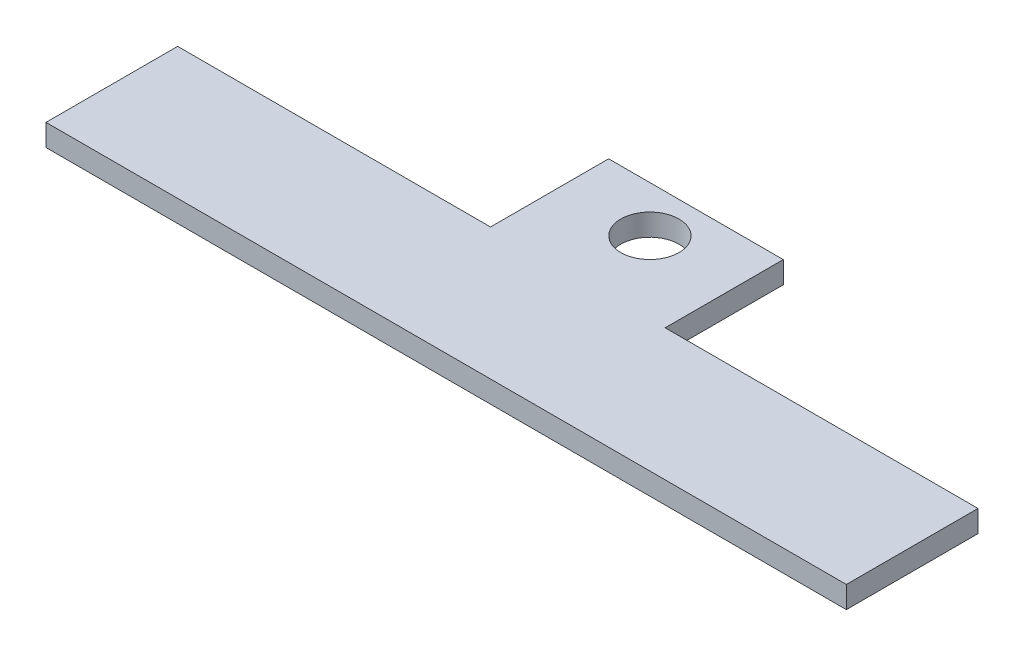
ISO-10303-21;
HEADER;
FILE_DESCRIPTION(('STEP AP214'),'2;1');
FILE_NAME('part.step','',(''),(''),'','','');
FILE_SCHEMA(('AUTOMOTIVE_DESIGN { 1 0 10303 214 1 1 1 1 }'));
ENDSEC;
DATA;
#1=APPLICATION_CONTEXT('core data for automotive mechanical design processes');
#2=APPLICATION_PROTOCOL_DEFINITION('international standard','automotive_design',2000,#1);
#3=PRODUCT_CONTEXT('',#1,'mechanical');
#4=PRODUCT('Part','Part','',(#3));
#5=PRODUCT_RELATED_PRODUCT_CATEGORY('part','',(#4));
#6=PRODUCT_DEFINITION_FORMATION('','',#4);
#7=PRODUCT_DEFINITION_CONTEXT('part definition',#1,'design');
#8=PRODUCT_DEFINITION('design','',#6,#7);
#9=PRODUCT_DEFINITION_SHAPE('','',#8);
#10=(LENGTH_UNIT() NAMED_UNIT(*) SI_UNIT(.MILLI.,.METRE.));
#11=(NAMED_UNIT(*) PLANE_ANGLE_UNIT() SI_UNIT($,.RADIAN.));
#12=(NAMED_UNIT(*) SI_UNIT($,.STERADIAN.) SOLID_ANGLE_UNIT());
#13=UNCERTAINTY_MEASURE_WITH_UNIT(LENGTH_MEASURE(1.E-05),#10,'distance_accuracy_value','');
#14=(GEOMETRIC_REPRESENTATION_CONTEXT(3) GLOBAL_UNCERTAINTY_ASSIGNED_CONTEXT((#13)) GLOBAL_UNIT_ASSIGNED_CONTEXT((#10,
#11,#12)) REPRESENTATION_CONTEXT('',''));
#15=CARTESIAN_POINT('',(0.,0.,0.));
#16=DIRECTION('',(0.,0.,1.));
#17=DIRECTION('',(1.,0.,0.));
#18=AXIS2_PLACEMENT_3D('',#15,#16,#17);
#19=CARTESIAN_POINT('',(0.,1.5,0.));
#20=DIRECTION('',(0.,-1.,0.));
#21=DIRECTION('',(0.,0.,-1.));
#22=AXIS2_PLACEMENT_3D('',#19,#20,#21);
#23=PLANE('',#22);
#24=DIRECTION('',(0.,0.,1.));
#25=VECTOR('',#24,1.);
#26=CARTESIAN_POINT('',(0.,1.5,0.));
#27=LINE('',#26,#25);
#28=CARTESIAN_POINT('',(0.,1.5,-9.04646840470653));
#29=VERTEX_POINT('',#28);
#30=CARTESIAN_POINT('',(0.,1.5,0.));
#31=VERTEX_POINT('',#30);
#32=EDGE_CURVE('E145',#29,#31,#27,.T.);
#33=ORIENTED_EDGE('',*,*,#32,.T.);
#34=DIRECTION('',(1.,0.,0.));
#35=VECTOR('',#34,1.);
#36=CARTESIAN_POINT('',(0.,1.5,0.));
#37=LINE('',#36,#35);
#38=CARTESIAN_POINT('',(55.,1.5,0.));
#39=VERTEX_POINT('',#38);
#40=EDGE_CURVE('E93',#31,#39,#37,.T.);
#41=ORIENTED_EDGE('',*,*,#40,.T.);
#42=DIRECTION('',(0.,0.,-1.));
#43=VECTOR('',#42,1.);
#44=CARTESIAN_POINT('',(55.,1.5,0.));
#45=LINE('',#44,#43);
#46=CARTESIAN_POINT('',(55.,1.5,-9.04646840470653));
#47=VERTEX_POINT('',#46);
#48=EDGE_CURVE('E160',#39,#47,#45,.T.);
#49=ORIENTED_EDGE('',*,*,#48,.T.);
#50=DIRECTION('',(-1.,0.,0.));
#51=VECTOR('',#50,1.);
#52=CARTESIAN_POINT('',(33.5,1.5,-9.04646840470653));
#53=LINE('',#52,#51);
#54=CARTESIAN_POINT('',(33.5,1.5,-9.04646840470653));
#55=VERTEX_POINT('',#54);
#56=EDGE_CURVE('E173',#47,#55,#53,.T.);
#57=ORIENTED_EDGE('',*,*,#56,.T.);
#58=DIRECTION('',(0.,0.,-1.));
#59=VECTOR('',#58,1.);
#60=CARTESIAN_POINT('',(33.5,1.5,-17.1649124070522));
#61=LINE('',#60,#59);
#62=CARTESIAN_POINT('',(33.5,1.5,-17.1649124070522));
#63=VERTEX_POINT('',#62);
#64=EDGE_CURVE('E112',#55,#63,#61,.T.);
#65=ORIENTED_EDGE('',*,*,#64,.T.);
#66=DIRECTION('',(-1.,0.,0.));
#67=VECTOR('',#66,1.);
#68=CARTESIAN_POINT('',(21.5,1.5,-17.1649124070522));
#69=LINE('',#68,#67);
#70=CARTESIAN_POINT('',(21.5,1.5,-17.1649124070522));
#71=VERTEX_POINT('',#70);
#72=EDGE_CURVE('E106',#63,#71,#69,.T.);
#73=ORIENTED_EDGE('',*,*,#72,.T.);
#74=DIRECTION('',(0.,0.,1.));
#75=VECTOR('',#74,1.);
#76=CARTESIAN_POINT('',(21.5,1.5,-9.04646840470653));
#77=LINE('',#76,#75);
#78=CARTESIAN_POINT('',(21.5,1.5,-9.04646840470653));
#79=VERTEX_POINT('',#78);
#80=EDGE_CURVE('E110',#71,#79,#77,.T.);
#81=ORIENTED_EDGE('',*,*,#80,.T.);
#82=DIRECTION('',(-1.,0.,0.));
#83=VECTOR('',#82,1.);
#84=CARTESIAN_POINT('',(0.,1.5,-9.04646840470653));
#85=LINE('',#84,#83);
#86=EDGE_CURVE('E50',#79,#29,#85,.T.);
#87=ORIENTED_EDGE('',*,*,#86,.T.);
#88=EDGE_LOOP('',(#33,#41,#49,#57,#65,#73,#81,#87));
#89=FACE_BOUND('',#88,.T.);
#90=CARTESIAN_POINT('',(27.5,1.5,-14.));
#91=DIRECTION('',(0.,1.,0.));
#92=DIRECTION('',(0.,0.,-1.));
#93=AXIS2_PLACEMENT_3D('',#90,#91,#92);
#94=CIRCLE('',#93,2.00000000000001);
#95=CARTESIAN_POINT('',(27.5,1.5,-16.));
#96=VERTEX_POINT('',#95);
#97=EDGE_CURVE('E134',#96,#96,#94,.T.);
#98=ORIENTED_EDGE('',*,*,#97,.F.);
#99=EDGE_LOOP('',(#98));
#100=FACE_BOUND('',#99,.T.);
#101=ADVANCED_FACE('F33',(#89,#100),#23,.F.);
#102=CARTESIAN_POINT('',(0.,0.,0.));
#103=DIRECTION('',(0.,-1.,0.));
#104=DIRECTION('',(0.,0.,-1.));
#105=AXIS2_PLACEMENT_3D('',#102,#103,#104);
#106=PLANE('',#105);
#107=DIRECTION('',(0.,0.,1.));
#108=VECTOR('',#107,1.);
#109=CARTESIAN_POINT('',(0.,0.,0.));
#110=LINE('',#109,#108);
#111=CARTESIAN_POINT('',(0.,0.,-9.04646840470653));
#112=VERTEX_POINT('',#111);
#113=CARTESIAN_POINT('',(0.,0.,0.));
#114=VERTEX_POINT('',#113);
#115=EDGE_CURVE('E130',#112,#114,#110,.T.);
#116=ORIENTED_EDGE('',*,*,#115,.F.);
#117=DIRECTION('',(-1.,0.,0.));
#118=VECTOR('',#117,1.);
#119=CARTESIAN_POINT('',(0.,0.,-9.04646840470653));
#120=LINE('',#119,#118);
#121=CARTESIAN_POINT('',(21.5,0.,-9.04646840470653));
#122=VERTEX_POINT('',#121);
#123=EDGE_CURVE('E85',#122,#112,#120,.T.);
#124=ORIENTED_EDGE('',*,*,#123,.F.);
#125=DIRECTION('',(0.,0.,1.));
#126=VECTOR('',#125,1.);
#127=CARTESIAN_POINT('',(21.5,0.,-9.04646840470653));
#128=LINE('',#127,#126);
#129=CARTESIAN_POINT('',(21.5,0.,-17.1649124070522));
#130=VERTEX_POINT('',#129);
#131=EDGE_CURVE('E79',#130,#122,#128,.T.);
#132=ORIENTED_EDGE('',*,*,#131,.F.);
#133=DIRECTION('',(-1.,0.,0.));
#134=VECTOR('',#133,1.);
#135=CARTESIAN_POINT('',(21.5,0.,-17.1649124070522));
#136=LINE('',#135,#134);
#137=CARTESIAN_POINT('',(33.5,0.,-17.1649124070522));
#138=VERTEX_POINT('',#137);
#139=EDGE_CURVE('E120',#138,#130,#136,.T.);
#140=ORIENTED_EDGE('',*,*,#139,.F.);
#141=DIRECTION('',(0.,0.,-1.));
#142=VECTOR('',#141,1.);
#143=CARTESIAN_POINT('',(33.5,0.,-17.1649124070522));
#144=LINE('',#143,#142);
#145=CARTESIAN_POINT('',(33.5,0.,-9.04646840470653));
#146=VERTEX_POINT('',#145);
#147=EDGE_CURVE('E140',#146,#138,#144,.T.);
#148=ORIENTED_EDGE('',*,*,#147,.F.);
#149=DIRECTION('',(-1.,0.,0.));
#150=VECTOR('',#149,1.);
#151=CARTESIAN_POINT('',(33.5,0.,-9.04646840470653));
#152=LINE('',#151,#150);
#153=CARTESIAN_POINT('',(55.,0.,-9.04646840470653));
#154=VERTEX_POINT('',#153);
#155=EDGE_CURVE('E138',#154,#146,#152,.T.);
#156=ORIENTED_EDGE('',*,*,#155,.F.);
#157=DIRECTION('',(0.,0.,-1.));
#158=VECTOR('',#157,1.);
#159=CARTESIAN_POINT('',(55.,0.,0.));
#160=LINE('',#159,#158);
#161=CARTESIAN_POINT('',(55.,0.,0.));
#162=VERTEX_POINT('',#161);
#163=EDGE_CURVE('E136',#162,#154,#160,.T.);
#164=ORIENTED_EDGE('',*,*,#163,.F.);
#165=DIRECTION('',(1.,0.,0.));
#166=VECTOR('',#165,1.);
#167=CARTESIAN_POINT('',(0.,0.,0.));
#168=LINE('',#167,#166);
#169=EDGE_CURVE('E133',#114,#162,#168,.T.);
#170=ORIENTED_EDGE('',*,*,#169,.F.);
#171=EDGE_LOOP('',(#116,#124,#132,#140,#148,#156,#164,#170));
#172=FACE_BOUND('',#171,.T.);
#173=CARTESIAN_POINT('',(27.5,0.,-14.));
#174=DIRECTION('',(0.,1.,0.));
#175=DIRECTION('',(0.,0.,-1.));
#176=AXIS2_PLACEMENT_3D('',#173,#174,#175);
#177=CIRCLE('',#176,2.00000000000001);
#178=CARTESIAN_POINT('',(27.5,0.,-16.));
#179=VERTEX_POINT('',#178);
#180=EDGE_CURVE('E179',#179,#179,#177,.T.);
#181=ORIENTED_EDGE('',*,*,#180,.T.);
#182=EDGE_LOOP('',(#181));
#183=FACE_BOUND('',#182,.T.);
#184=ADVANCED_FACE('F164',(#172,#183),#106,.T.);
#185=CARTESIAN_POINT('',(0.,1.5,0.));
#186=DIRECTION('',(1.,0.,0.));
#187=DIRECTION('',(0.,0.,-1.));
#188=AXIS2_PLACEMENT_3D('',#185,#186,#187);
#189=PLANE('',#188);
#190=ORIENTED_EDGE('',*,*,#115,.T.);
#191=DIRECTION('',(0.,-1.,0.));
#192=VECTOR('',#191,1.);
#193=CARTESIAN_POINT('',(0.,1.5,0.));
#194=LINE('',#193,#192);
#195=EDGE_CURVE('E11',#31,#114,#194,.T.);
#196=ORIENTED_EDGE('',*,*,#195,.F.);
#197=ORIENTED_EDGE('',*,*,#32,.F.);
#198=DIRECTION('',(0.,-1.,0.));
#199=VECTOR('',#198,1.);
#200=CARTESIAN_POINT('',(0.,1.5,-9.04646840470653));
#201=LINE('',#200,#199);
#202=EDGE_CURVE('E126',#29,#112,#201,.T.);
#203=ORIENTED_EDGE('',*,*,#202,.T.);
#204=EDGE_LOOP('',(#190,#196,#197,#203));
#205=FACE_BOUND('',#204,.T.);
#206=ADVANCED_FACE('F35',(#205),#189,.F.);
#207=CARTESIAN_POINT('',(0.,1.5,0.));
#208=DIRECTION('',(0.,0.,-1.));
#209=DIRECTION('',(-1.,0.,0.));
#210=AXIS2_PLACEMENT_3D('',#207,#208,#209);
#211=PLANE('',#210);
#212=ORIENTED_EDGE('',*,*,#169,.T.);
#213=DIRECTION('',(0.,-1.,0.));
#214=VECTOR('',#213,1.);
#215=CARTESIAN_POINT('',(55.,1.5,0.));
#216=LINE('',#215,#214);
#217=EDGE_CURVE('E42',#39,#162,#216,.T.);
#218=ORIENTED_EDGE('',*,*,#217,.F.);
#219=ORIENTED_EDGE('',*,*,#40,.F.);
#220=ORIENTED_EDGE('',*,*,#195,.T.);
#221=EDGE_LOOP('',(#212,#218,#219,#220));
#222=FACE_BOUND('',#221,.T.);
#223=ADVANCED_FACE('F207',(#222),#211,.F.);
#224=CARTESIAN_POINT('',(55.,1.5,0.));
#225=DIRECTION('',(-1.,0.,0.));
#226=DIRECTION('',(0.,0.,1.));
#227=AXIS2_PLACEMENT_3D('',#224,#225,#226);
#228=PLANE('',#227);
#229=ORIENTED_EDGE('',*,*,#163,.T.);
#230=DIRECTION('',(0.,-1.,0.));
#231=VECTOR('',#230,1.);
#232=CARTESIAN_POINT('',(55.,1.5,-9.04646840470653));
#233=LINE('',#232,#231);
#234=EDGE_CURVE('E152',#47,#154,#233,.T.);
#235=ORIENTED_EDGE('',*,*,#234,.F.);
#236=ORIENTED_EDGE('',*,*,#48,.F.);
#237=ORIENTED_EDGE('',*,*,#217,.T.);
#238=EDGE_LOOP('',(#229,#235,#236,#237));
#239=FACE_BOUND('',#238,.T.);
#240=ADVANCED_FACE('F158',(#239),#228,.F.);
#241=CARTESIAN_POINT('',(33.5,1.5,-9.04646840470653));
#242=DIRECTION('',(0.,0.,1.));
#243=DIRECTION('',(1.,0.,0.));
#244=AXIS2_PLACEMENT_3D('',#241,#242,#243);
#245=PLANE('',#244);
#246=ORIENTED_EDGE('',*,*,#155,.T.);
#247=DIRECTION('',(0.,-1.,0.));
#248=VECTOR('',#247,1.);
#249=CARTESIAN_POINT('',(33.5,1.5,-9.04646840470653));
#250=LINE('',#249,#248);
#251=EDGE_CURVE('E149',#55,#146,#250,.T.);
#252=ORIENTED_EDGE('',*,*,#251,.F.);
#253=ORIENTED_EDGE('',*,*,#56,.F.);
#254=ORIENTED_EDGE('',*,*,#234,.T.);
#255=EDGE_LOOP('',(#246,#252,#253,#254));
#256=FACE_BOUND('',#255,.T.);
#257=ADVANCED_FACE('F169',(#256),#245,.F.);
#258=CARTESIAN_POINT('',(33.5,1.5,-17.1649124070522));
#259=DIRECTION('',(-1.,0.,0.));
#260=DIRECTION('',(0.,0.,1.));
#261=AXIS2_PLACEMENT_3D('',#258,#259,#260);
#262=PLANE('',#261);
#263=ORIENTED_EDGE('',*,*,#147,.T.);
#264=DIRECTION('',(0.,-1.,0.));
#265=VECTOR('',#264,1.);
#266=CARTESIAN_POINT('',(33.5,1.5,-17.1649124070522));
#267=LINE('',#266,#265);
#268=EDGE_CURVE('E121',#63,#138,#267,.T.);
#269=ORIENTED_EDGE('',*,*,#268,.F.);
#270=ORIENTED_EDGE('',*,*,#64,.F.);
#271=ORIENTED_EDGE('',*,*,#251,.T.);
#272=EDGE_LOOP('',(#263,#269,#270,#271));
#273=FACE_BOUND('',#272,.T.);
#274=ADVANCED_FACE('F172',(#273),#262,.F.);
#275=CARTESIAN_POINT('',(21.5,1.5,-17.1649124070522));
#276=DIRECTION('',(0.,0.,1.));
#277=DIRECTION('',(1.,0.,0.));
#278=AXIS2_PLACEMENT_3D('',#275,#276,#277);
#279=PLANE('',#278);
#280=ORIENTED_EDGE('',*,*,#139,.T.);
#281=DIRECTION('',(0.,-1.,0.));
#282=VECTOR('',#281,1.);
#283=CARTESIAN_POINT('',(21.5,1.5,-17.1649124070522));
#284=LINE('',#283,#282);
#285=EDGE_CURVE('E117',#71,#130,#284,.T.);
#286=ORIENTED_EDGE('',*,*,#285,.F.);
#287=ORIENTED_EDGE('',*,*,#72,.F.);
#288=ORIENTED_EDGE('',*,*,#268,.T.);
#289=EDGE_LOOP('',(#280,#286,#287,#288));
#290=FACE_BOUND('',#289,.T.);
#291=ADVANCED_FACE('F118',(#290),#279,.F.);
#292=CARTESIAN_POINT('',(21.5,1.5,-9.04646840470653));
#293=DIRECTION('',(1.,0.,0.));
#294=DIRECTION('',(0.,0.,-1.));
#295=AXIS2_PLACEMENT_3D('',#292,#293,#294);
#296=PLANE('',#295);
#297=ORIENTED_EDGE('',*,*,#131,.T.);
#298=DIRECTION('',(0.,-1.,0.));
#299=VECTOR('',#298,1.);
#300=CARTESIAN_POINT('',(21.5,1.5,-9.04646840470653));
#301=LINE('',#300,#299);
#302=EDGE_CURVE('E122',#79,#122,#301,.T.);
#303=ORIENTED_EDGE('',*,*,#302,.F.);
#304=ORIENTED_EDGE('',*,*,#80,.F.);
#305=ORIENTED_EDGE('',*,*,#285,.T.);
#306=EDGE_LOOP('',(#297,#303,#304,#305));
#307=FACE_BOUND('',#306,.T.);
#308=ADVANCED_FACE('F124',(#307),#296,.F.);
#309=CARTESIAN_POINT('',(0.,1.5,-9.04646840470653));
#310=DIRECTION('',(0.,0.,1.));
#311=DIRECTION('',(1.,0.,0.));
#312=AXIS2_PLACEMENT_3D('',#309,#310,#311);
#313=PLANE('',#312);
#314=ORIENTED_EDGE('',*,*,#123,.T.);
#315=ORIENTED_EDGE('',*,*,#202,.F.);
#316=ORIENTED_EDGE('',*,*,#86,.F.);
#317=ORIENTED_EDGE('',*,*,#302,.T.);
#318=EDGE_LOOP('',(#314,#315,#316,#317));
#319=FACE_BOUND('',#318,.T.);
#320=ADVANCED_FACE('F195',(#319),#313,.F.);
#321=CARTESIAN_POINT('',(27.5,1.5,-14.));
#322=DIRECTION('',(0.,-1.,0.));
#323=DIRECTION('',(0.,0.,-1.));
#324=AXIS2_PLACEMENT_3D('',#321,#322,#323);
#325=CYLINDRICAL_SURFACE('',#324,2.00000000000001);
#326=ORIENTED_EDGE('',*,*,#97,.T.);
#327=EDGE_LOOP('',(#326));
#328=FACE_BOUND('',#327,.T.);
#329=ORIENTED_EDGE('',*,*,#180,.F.);
#330=EDGE_LOOP('',(#329));
#331=FACE_BOUND('',#330,.T.);
#332=ADVANCED_FACE('F185',(#328,#331),#325,.F.);
#333=CLOSED_SHELL('',(#101,#184,#206,#223,#240,#257,#274,#291,#308,#320,#332));
#334=MANIFOLD_SOLID_BREP('B2',#333);
#335=ADVANCED_BREP_SHAPE_REPRESENTATION('',(#18,#334),#14);
#336=SHAPE_DEFINITION_REPRESENTATION(#9,#335);
ENDSEC;
END-ISO-10303-21;
